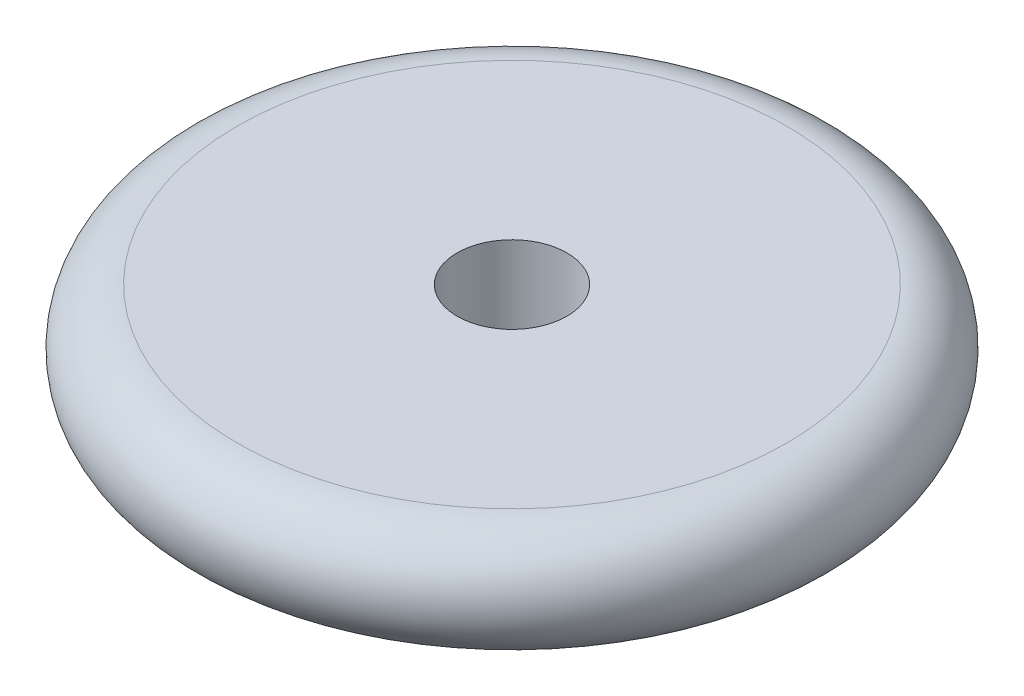
ISO-10303-21;
HEADER;
FILE_DESCRIPTION(('STEP AP214'),'2;1');
FILE_NAME('part.step','',(''),(''),'','','');
FILE_SCHEMA(('AUTOMOTIVE_DESIGN { 1 0 10303 214 1 1 1 1 }'));
ENDSEC;
DATA;
#1=APPLICATION_CONTEXT('core data for automotive mechanical design processes');
#2=APPLICATION_PROTOCOL_DEFINITION('international standard','automotive_design',2000,#1);
#3=PRODUCT_CONTEXT('',#1,'mechanical');
#4=PRODUCT('Part','Part','',(#3));
#5=PRODUCT_RELATED_PRODUCT_CATEGORY('part','',(#4));
#6=PRODUCT_DEFINITION_FORMATION('','',#4);
#7=PRODUCT_DEFINITION_CONTEXT('part definition',#1,'design');
#8=PRODUCT_DEFINITION('design','',#6,#7);
#9=PRODUCT_DEFINITION_SHAPE('','',#8);
#10=(LENGTH_UNIT() NAMED_UNIT(*) SI_UNIT(.MILLI.,.METRE.));
#11=(NAMED_UNIT(*) PLANE_ANGLE_UNIT() SI_UNIT($,.RADIAN.));
#12=(NAMED_UNIT(*) SI_UNIT($,.STERADIAN.) SOLID_ANGLE_UNIT());
#13=UNCERTAINTY_MEASURE_WITH_UNIT(LENGTH_MEASURE(1.E-05),#10,'distance_accuracy_value','');
#14=(GEOMETRIC_REPRESENTATION_CONTEXT(3) GLOBAL_UNCERTAINTY_ASSIGNED_CONTEXT((#13)) GLOBAL_UNIT_ASSIGNED_CONTEXT((#10,
#11,#12)) REPRESENTATION_CONTEXT('',''));
#15=CARTESIAN_POINT('',(0.,0.,0.));
#16=DIRECTION('',(0.,0.,1.));
#17=DIRECTION('',(1.,0.,0.));
#18=AXIS2_PLACEMENT_3D('',#15,#16,#17);
#19=CARTESIAN_POINT('',(0.,-10.,0.));
#20=DIRECTION('',(0.,-1.,0.));
#21=DIRECTION('',(1.,0.,0.));
#22=AXIS2_PLACEMENT_3D('',#19,#20,#21);
#23=TOROIDAL_SURFACE('',#22,50.,10.);
#24=CARTESIAN_POINT('',(0.,-20.,0.));
#25=DIRECTION('',(0.,-1.,0.));
#26=DIRECTION('',(1.,0.,0.));
#27=AXIS2_PLACEMENT_3D('',#24,#25,#26);
#28=CIRCLE('',#27,50.);
#29=CARTESIAN_POINT('',(50.,-20.,0.));
#30=VERTEX_POINT('',#29);
#31=EDGE_CURVE('E10',#30,#30,#28,.T.);
#32=ORIENTED_EDGE('',*,*,#31,.F.);
#33=EDGE_LOOP('',(#32));
#34=FACE_BOUND('',#33,.T.);
#35=CARTESIAN_POINT('',(0.,0.,0.));
#36=DIRECTION('',(0.,-1.,0.));
#37=DIRECTION('',(1.,0.,0.));
#38=AXIS2_PLACEMENT_3D('',#35,#36,#37);
#39=CIRCLE('',#38,50.);
#40=CARTESIAN_POINT('',(50.,0.,0.));
#41=VERTEX_POINT('',#40);
#42=EDGE_CURVE('E22',#41,#41,#39,.F.);
#43=ORIENTED_EDGE('',*,*,#42,.F.);
#44=EDGE_LOOP('',(#43));
#45=FACE_BOUND('',#44,.T.);
#46=ADVANCED_FACE('F15',(#34,#45),#23,.T.);
#47=CARTESIAN_POINT('',(0.,-20.,0.));
#48=DIRECTION('',(0.,-1.,0.));
#49=DIRECTION('',(1.,0.,0.));
#50=AXIS2_PLACEMENT_3D('',#47,#48,#49);
#51=PLANE('',#50);
#52=CARTESIAN_POINT('',(0.,-20.,0.));
#53=DIRECTION('',(0.,-1.,0.));
#54=DIRECTION('',(1.,0.,0.));
#55=AXIS2_PLACEMENT_3D('',#52,#53,#54);
#56=CIRCLE('',#55,10.);
#57=CARTESIAN_POINT('',(10.,-20.,0.));
#58=VERTEX_POINT('',#57);
#59=EDGE_CURVE('E29',#58,#58,#56,.F.);
#60=ORIENTED_EDGE('',*,*,#59,.T.);
#61=EDGE_LOOP('',(#60));
#62=FACE_BOUND('',#61,.T.);
#63=ORIENTED_EDGE('',*,*,#31,.T.);
#64=EDGE_LOOP('',(#63));
#65=FACE_BOUND('',#64,.T.);
#66=ADVANCED_FACE('F48',(#62,#65),#51,.T.);
#67=CARTESIAN_POINT('',(0.,0.,0.));
#68=DIRECTION('',(0.,-1.,0.));
#69=DIRECTION('',(1.,0.,0.));
#70=AXIS2_PLACEMENT_3D('',#67,#68,#69);
#71=PLANE('',#70);
#72=CARTESIAN_POINT('',(0.,0.,0.));
#73=DIRECTION('',(0.,-1.,0.));
#74=DIRECTION('',(1.,0.,0.));
#75=AXIS2_PLACEMENT_3D('',#72,#73,#74);
#76=CIRCLE('',#75,10.);
#77=CARTESIAN_POINT('',(10.,0.,0.));
#78=VERTEX_POINT('',#77);
#79=EDGE_CURVE('E35',#78,#78,#76,.F.);
#80=ORIENTED_EDGE('',*,*,#79,.F.);
#81=EDGE_LOOP('',(#80));
#82=FACE_BOUND('',#81,.T.);
#83=ORIENTED_EDGE('',*,*,#42,.T.);
#84=EDGE_LOOP('',(#83));
#85=FACE_BOUND('',#84,.T.);
#86=ADVANCED_FACE('F46',(#82,#85),#71,.F.);
#87=CARTESIAN_POINT('',(0.,-69.,0.));
#88=DIRECTION('',(0.,1.,0.));
#89=DIRECTION('',(-1.,0.,0.));
#90=AXIS2_PLACEMENT_3D('',#87,#88,#89);
#91=CYLINDRICAL_SURFACE('',#90,10.);
#92=ORIENTED_EDGE('',*,*,#59,.F.);
#93=EDGE_LOOP('',(#92));
#94=FACE_BOUND('',#93,.T.);
#95=ORIENTED_EDGE('',*,*,#79,.T.);
#96=EDGE_LOOP('',(#95));
#97=FACE_BOUND('',#96,.T.);
#98=ADVANCED_FACE('F44',(#94,#97),#91,.F.);
#99=CLOSED_SHELL('',(#46,#66,#86,#98));
#100=MANIFOLD_SOLID_BREP('B1',#99);
#101=ADVANCED_BREP_SHAPE_REPRESENTATION('',(#18,#100),#14);
#102=SHAPE_DEFINITION_REPRESENTATION(#9,#101);
ENDSEC;
END-ISO-10303-21;
